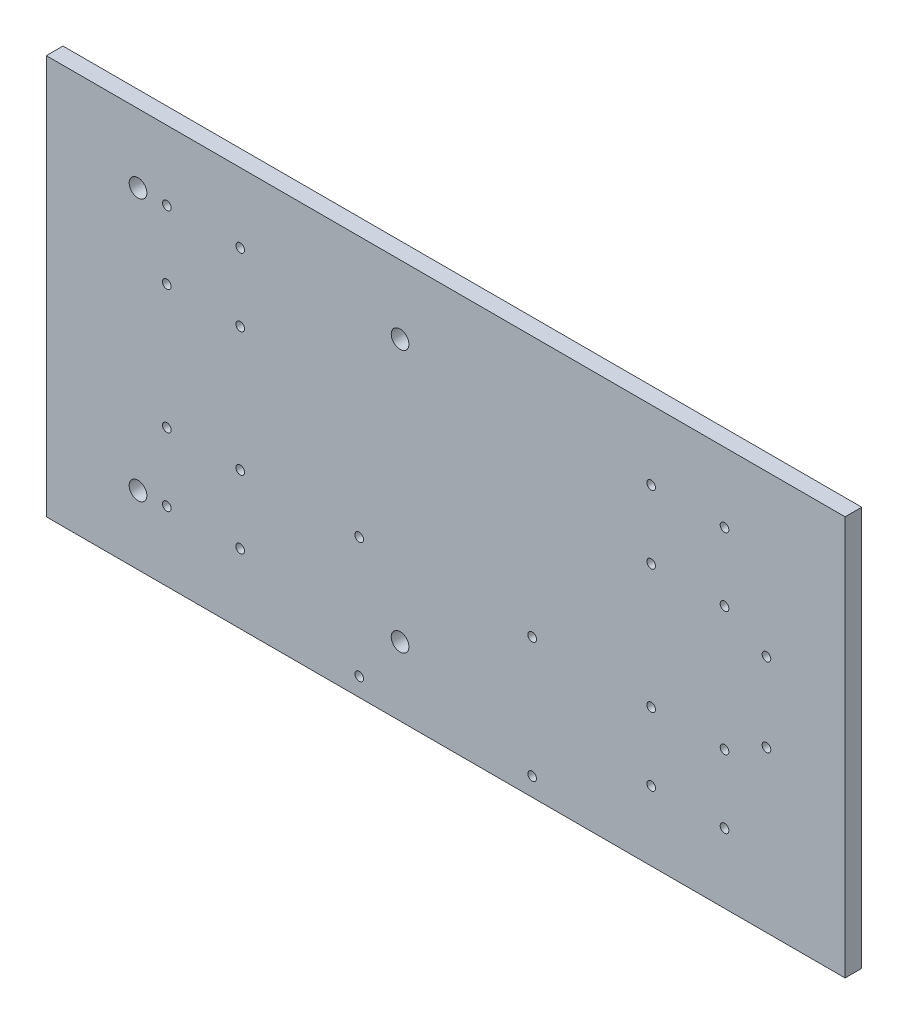
ISO-10303-21;
HEADER;
FILE_DESCRIPTION(('STEP AP214'),'2;1');
FILE_NAME('part.step','',(''),(''),'','','');
FILE_SCHEMA(('AUTOMOTIVE_DESIGN { 1 0 10303 214 1 1 1 1 }'));
ENDSEC;
DATA;
#1=APPLICATION_CONTEXT('core data for automotive mechanical design processes');
#2=APPLICATION_PROTOCOL_DEFINITION('international standard','automotive_design',2000,#1);
#3=PRODUCT_CONTEXT('',#1,'mechanical');
#4=PRODUCT('Part','Part','',(#3));
#5=PRODUCT_RELATED_PRODUCT_CATEGORY('part','',(#4));
#6=PRODUCT_DEFINITION_FORMATION('','',#4);
#7=PRODUCT_DEFINITION_CONTEXT('part definition',#1,'design');
#8=PRODUCT_DEFINITION('design','',#6,#7);
#9=PRODUCT_DEFINITION_SHAPE('','',#8);
#10=(LENGTH_UNIT() NAMED_UNIT(*) SI_UNIT(.MILLI.,.METRE.));
#11=(NAMED_UNIT(*) PLANE_ANGLE_UNIT() SI_UNIT($,.RADIAN.));
#12=(NAMED_UNIT(*) SI_UNIT($,.STERADIAN.) SOLID_ANGLE_UNIT());
#13=UNCERTAINTY_MEASURE_WITH_UNIT(LENGTH_MEASURE(1.E-05),#10,'distance_accuracy_value','');
#14=(GEOMETRIC_REPRESENTATION_CONTEXT(3) GLOBAL_UNCERTAINTY_ASSIGNED_CONTEXT((#13)) GLOBAL_UNIT_ASSIGNED_CONTEXT((#10,
#11,#12)) REPRESENTATION_CONTEXT('',''));
#15=CARTESIAN_POINT('',(0.,0.,0.));
#16=DIRECTION('',(0.,0.,1.));
#17=DIRECTION('',(1.,0.,0.));
#18=AXIS2_PLACEMENT_3D('',#15,#16,#17);
#19=CARTESIAN_POINT('',(152.4,76.2,6.35));
#20=DIRECTION('',(-1.,0.,0.));
#21=DIRECTION('',(0.,0.,1.));
#22=AXIS2_PLACEMENT_3D('',#19,#20,#21);
#23=PLANE('',#22);
#24=DIRECTION('',(0.,1.,0.));
#25=VECTOR('',#24,1.);
#26=CARTESIAN_POINT('',(152.4,76.2,0.));
#27=LINE('',#26,#25);
#28=CARTESIAN_POINT('',(152.4,-76.2,0.));
#29=VERTEX_POINT('',#28);
#30=CARTESIAN_POINT('',(152.4,76.2,0.));
#31=VERTEX_POINT('',#30);
#32=EDGE_CURVE('E97',#29,#31,#27,.T.);
#33=ORIENTED_EDGE('',*,*,#32,.T.);
#34=DIRECTION('',(0.,0.,-1.));
#35=VECTOR('',#34,1.);
#36=CARTESIAN_POINT('',(152.4,76.2,6.35));
#37=LINE('',#36,#35);
#38=CARTESIAN_POINT('',(152.4,76.2,6.35));
#39=VERTEX_POINT('',#38);
#40=EDGE_CURVE('E11',#39,#31,#37,.T.);
#41=ORIENTED_EDGE('',*,*,#40,.F.);
#42=DIRECTION('',(0.,1.,0.));
#43=VECTOR('',#42,1.);
#44=CARTESIAN_POINT('',(152.4,76.2,6.35));
#45=LINE('',#44,#43);
#46=CARTESIAN_POINT('',(152.4,-76.2,6.35));
#47=VERTEX_POINT('',#46);
#48=EDGE_CURVE('E85',#47,#39,#45,.T.);
#49=ORIENTED_EDGE('',*,*,#48,.F.);
#50=DIRECTION('',(0.,0.,-1.));
#51=VECTOR('',#50,1.);
#52=CARTESIAN_POINT('',(152.4,-76.2,6.35));
#53=LINE('',#52,#51);
#54=EDGE_CURVE('E93',#47,#29,#53,.T.);
#55=ORIENTED_EDGE('',*,*,#54,.T.);
#56=EDGE_LOOP('',(#33,#41,#49,#55));
#57=FACE_BOUND('',#56,.T.);
#58=ADVANCED_FACE('F34',(#57),#23,.F.);
#59=CARTESIAN_POINT('',(-152.4,76.2,6.35));
#60=DIRECTION('',(0.,-1.,0.));
#61=DIRECTION('',(0.,0.,-1.));
#62=AXIS2_PLACEMENT_3D('',#59,#60,#61);
#63=PLANE('',#62);
#64=DIRECTION('',(-1.,0.,0.));
#65=VECTOR('',#64,1.);
#66=CARTESIAN_POINT('',(-152.4,76.2,0.));
#67=LINE('',#66,#65);
#68=CARTESIAN_POINT('',(-152.4,76.2,0.));
#69=VERTEX_POINT('',#68);
#70=EDGE_CURVE('E89',#31,#69,#67,.T.);
#71=ORIENTED_EDGE('',*,*,#70,.T.);
#72=DIRECTION('',(0.,0.,-1.));
#73=VECTOR('',#72,1.);
#74=CARTESIAN_POINT('',(-152.4,76.2,6.35));
#75=LINE('',#74,#73);
#76=CARTESIAN_POINT('',(-152.4,76.2,6.35));
#77=VERTEX_POINT('',#76);
#78=EDGE_CURVE('E42',#77,#69,#75,.T.);
#79=ORIENTED_EDGE('',*,*,#78,.F.);
#80=DIRECTION('',(-1.,0.,0.));
#81=VECTOR('',#80,1.);
#82=CARTESIAN_POINT('',(-152.4,76.2,6.35));
#83=LINE('',#82,#81);
#84=EDGE_CURVE('E80',#39,#77,#83,.T.);
#85=ORIENTED_EDGE('',*,*,#84,.F.);
#86=ORIENTED_EDGE('',*,*,#40,.T.);
#87=EDGE_LOOP('',(#71,#79,#85,#86));
#88=FACE_BOUND('',#87,.T.);
#89=ADVANCED_FACE('F88',(#88),#63,.F.);
#90=CARTESIAN_POINT('',(-152.4,76.2,6.35));
#91=DIRECTION('',(1.,0.,0.));
#92=DIRECTION('',(0.,1.,0.));
#93=AXIS2_PLACEMENT_3D('',#90,#91,#92);
#94=PLANE('',#93);
#95=DIRECTION('',(0.,-1.,0.));
#96=VECTOR('',#95,1.);
#97=CARTESIAN_POINT('',(-152.4,76.2,0.));
#98=LINE('',#97,#96);
#99=CARTESIAN_POINT('',(-152.4,-76.2,0.));
#100=VERTEX_POINT('',#99);
#101=EDGE_CURVE('E67',#69,#100,#98,.T.);
#102=ORIENTED_EDGE('',*,*,#101,.T.);
#103=DIRECTION('',(0.,0.,-1.));
#104=VECTOR('',#103,1.);
#105=CARTESIAN_POINT('',(-152.4,-76.2,6.35));
#106=LINE('',#105,#104);
#107=CARTESIAN_POINT('',(-152.4,-76.2,6.35));
#108=VERTEX_POINT('',#107);
#109=EDGE_CURVE('E90',#108,#100,#106,.T.);
#110=ORIENTED_EDGE('',*,*,#109,.F.);
#111=DIRECTION('',(0.,-1.,0.));
#112=VECTOR('',#111,1.);
#113=CARTESIAN_POINT('',(-152.4,76.2,6.35));
#114=LINE('',#113,#112);
#115=EDGE_CURVE('E83',#77,#108,#114,.T.);
#116=ORIENTED_EDGE('',*,*,#115,.F.);
#117=ORIENTED_EDGE('',*,*,#78,.T.);
#118=EDGE_LOOP('',(#102,#110,#116,#117));
#119=FACE_BOUND('',#118,.T.);
#120=ADVANCED_FACE('F91',(#119),#94,.F.);
#121=CARTESIAN_POINT('',(-152.4,-76.2,6.35));
#122=DIRECTION('',(0.,1.,0.));
#123=DIRECTION('',(0.,0.,1.));
#124=AXIS2_PLACEMENT_3D('',#121,#122,#123);
#125=PLANE('',#124);
#126=DIRECTION('',(1.,0.,0.));
#127=VECTOR('',#126,1.);
#128=CARTESIAN_POINT('',(-152.4,-76.2,0.));
#129=LINE('',#128,#127);
#130=EDGE_CURVE('E73',#100,#29,#129,.T.);
#131=ORIENTED_EDGE('',*,*,#130,.T.);
#132=ORIENTED_EDGE('',*,*,#54,.F.);
#133=DIRECTION('',(1.,0.,0.));
#134=VECTOR('',#133,1.);
#135=CARTESIAN_POINT('',(-152.4,-76.2,6.35));
#136=LINE('',#135,#134);
#137=EDGE_CURVE('E50',#108,#47,#136,.T.);
#138=ORIENTED_EDGE('',*,*,#137,.F.);
#139=ORIENTED_EDGE('',*,*,#109,.T.);
#140=EDGE_LOOP('',(#131,#132,#138,#139));
#141=FACE_BOUND('',#140,.T.);
#142=ADVANCED_FACE('F105',(#141),#125,.F.);
#143=CARTESIAN_POINT('',(0.,0.,6.35));
#144=DIRECTION('',(0.,0.,1.));
#145=DIRECTION('',(1.,0.,0.));
#146=AXIS2_PLACEMENT_3D('',#143,#144,#145);
#147=PLANE('',#146);
#148=CARTESIAN_POINT('',(122.4,-15.,6.35));
#149=DIRECTION('',(0.,0.,1.));
#150=DIRECTION('',(1.,0.,0.));
#151=AXIS2_PLACEMENT_3D('',#148,#149,#150);
#152=CIRCLE('',#151,1.65000000000002);
#153=CARTESIAN_POINT('',(124.05,-15.,6.35));
#154=VERTEX_POINT('',#153);
#155=EDGE_CURVE('E261',#154,#154,#152,.T.);
#156=ORIENTED_EDGE('',*,*,#155,.F.);
#157=EDGE_LOOP('',(#156));
#158=FACE_BOUND('',#157,.T.);
#159=CARTESIAN_POINT('',(122.4,15.,6.35));
#160=DIRECTION('',(0.,0.,1.));
#161=DIRECTION('',(1.,0.,0.));
#162=AXIS2_PLACEMENT_3D('',#159,#160,#161);
#163=CIRCLE('',#162,1.65000000000002);
#164=CARTESIAN_POINT('',(124.05,15.,6.35));
#165=VERTEX_POINT('',#164);
#166=EDGE_CURVE('E255',#165,#165,#163,.T.);
#167=ORIENTED_EDGE('',*,*,#166,.F.);
#168=EDGE_LOOP('',(#167));
#169=FACE_BOUND('',#168,.T.);
#170=CARTESIAN_POINT('',(-32.9999999999985,-23.2,6.35));
#171=DIRECTION('',(0.,0.,-1.));
#172=DIRECTION('',(-1.,0.,0.));
#173=AXIS2_PLACEMENT_3D('',#170,#171,#172);
#174=CIRCLE('',#173,1.65);
#175=CARTESIAN_POINT('',(-34.6499999999985,-23.2,6.35));
#176=VERTEX_POINT('',#175);
#177=EDGE_CURVE('E234',#176,#176,#174,.T.);
#178=ORIENTED_EDGE('',*,*,#177,.T.);
#179=EDGE_LOOP('',(#178));
#180=FACE_BOUND('',#179,.T.);
#181=CARTESIAN_POINT('',(33.0000000000015,-23.2,6.35));
#182=DIRECTION('',(0.,0.,-1.));
#183=DIRECTION('',(-1.,0.,0.));
#184=AXIS2_PLACEMENT_3D('',#181,#182,#183);
#185=CIRCLE('',#184,1.65);
#186=CARTESIAN_POINT('',(31.3500000000015,-23.2,6.35));
#187=VERTEX_POINT('',#186);
#188=EDGE_CURVE('E247',#187,#187,#185,.T.);
#189=ORIENTED_EDGE('',*,*,#188,.T.);
#190=EDGE_LOOP('',(#189));
#191=FACE_BOUND('',#190,.T.);
#192=CARTESIAN_POINT('',(33.0000000000015,-69.2,6.35));
#193=DIRECTION('',(0.,0.,-1.));
#194=DIRECTION('',(-1.,0.,0.));
#195=AXIS2_PLACEMENT_3D('',#192,#193,#194);
#196=CIRCLE('',#195,1.65);
#197=CARTESIAN_POINT('',(31.3500000000015,-69.2,6.35));
#198=VERTEX_POINT('',#197);
#199=EDGE_CURVE('E240',#198,#198,#196,.T.);
#200=ORIENTED_EDGE('',*,*,#199,.T.);
#201=EDGE_LOOP('',(#200));
#202=FACE_BOUND('',#201,.T.);
#203=CARTESIAN_POINT('',(-32.9999999999985,-69.2,6.35));
#204=DIRECTION('',(0.,0.,-1.));
#205=DIRECTION('',(-1.,0.,0.));
#206=AXIS2_PLACEMENT_3D('',#203,#204,#205);
#207=CIRCLE('',#206,1.65);
#208=CARTESIAN_POINT('',(-34.6499999999985,-69.2,6.35));
#209=VERTEX_POINT('',#208);
#210=EDGE_CURVE('E217',#209,#209,#207,.T.);
#211=ORIENTED_EDGE('',*,*,#210,.T.);
#212=EDGE_LOOP('',(#211));
#213=FACE_BOUND('',#212,.T.);
#214=CARTESIAN_POINT('',(-117.4,49.9998733487398,6.35));
#215=DIRECTION('',(0.,0.,1.));
#216=DIRECTION('',(1.,0.,0.));
#217=AXIS2_PLACEMENT_3D('',#214,#215,#216);
#218=CIRCLE('',#217,3.375);
#219=CARTESIAN_POINT('',(-114.025,49.9998733487398,6.35));
#220=VERTEX_POINT('',#219);
#221=EDGE_CURVE('E226',#220,#220,#218,.T.);
#222=ORIENTED_EDGE('',*,*,#221,.F.);
#223=EDGE_LOOP('',(#222));
#224=FACE_BOUND('',#223,.T.);
#225=CARTESIAN_POINT('',(-17.4000000000002,-50.0001266512602,6.35));
#226=DIRECTION('',(0.,0.,1.));
#227=DIRECTION('',(1.,0.,0.));
#228=AXIS2_PLACEMENT_3D('',#225,#226,#227);
#229=CIRCLE('',#228,3.375);
#230=CARTESIAN_POINT('',(-14.0250000000002,-50.0001266512602,6.35));
#231=VERTEX_POINT('',#230);
#232=EDGE_CURVE('E220',#231,#231,#229,.T.);
#233=ORIENTED_EDGE('',*,*,#232,.F.);
#234=EDGE_LOOP('',(#233));
#235=FACE_BOUND('',#234,.T.);
#236=CARTESIAN_POINT('',(-17.4000000000002,49.9998733487398,6.35));
#237=DIRECTION('',(0.,0.,1.));
#238=DIRECTION('',(1.,0.,0.));
#239=AXIS2_PLACEMENT_3D('',#236,#237,#238);
#240=CIRCLE('',#239,3.375);
#241=CARTESIAN_POINT('',(-14.0250000000002,49.9998733487398,6.35));
#242=VERTEX_POINT('',#241);
#243=EDGE_CURVE('E213',#242,#242,#240,.T.);
#244=ORIENTED_EDGE('',*,*,#243,.F.);
#245=EDGE_LOOP('',(#244));
#246=FACE_BOUND('',#245,.T.);
#247=CARTESIAN_POINT('',(-117.4,-50.0001266512602,6.35));
#248=DIRECTION('',(0.,0.,1.));
#249=DIRECTION('',(1.,0.,0.));
#250=AXIS2_PLACEMENT_3D('',#247,#248,#249);
#251=CIRCLE('',#250,3.375);
#252=CARTESIAN_POINT('',(-114.025,-50.0001266512602,6.35));
#253=VERTEX_POINT('',#252);
#254=EDGE_CURVE('E207',#253,#253,#251,.T.);
#255=ORIENTED_EDGE('',*,*,#254,.F.);
#256=EDGE_LOOP('',(#255));
#257=FACE_BOUND('',#256,.T.);
#258=CARTESIAN_POINT('',(78.4,49.7,6.35));
#259=DIRECTION('',(0.,0.,1.));
#260=DIRECTION('',(1.,0.,0.));
#261=AXIS2_PLACEMENT_3D('',#258,#259,#260);
#262=CIRCLE('',#261,1.65);
#263=CARTESIAN_POINT('',(80.05,49.7,6.35));
#264=VERTEX_POINT('',#263);
#265=EDGE_CURVE('E200',#264,#264,#262,.T.);
#266=ORIENTED_EDGE('',*,*,#265,.F.);
#267=EDGE_LOOP('',(#266));
#268=FACE_BOUND('',#267,.T.);
#269=CARTESIAN_POINT('',(78.4,23.7,6.35));
#270=DIRECTION('',(0.,0.,1.));
#271=DIRECTION('',(1.,0.,0.));
#272=AXIS2_PLACEMENT_3D('',#269,#270,#271);
#273=CIRCLE('',#272,1.65);
#274=CARTESIAN_POINT('',(80.05,23.7,6.35));
#275=VERTEX_POINT('',#274);
#276=EDGE_CURVE('E194',#275,#275,#273,.T.);
#277=ORIENTED_EDGE('',*,*,#276,.F.);
#278=EDGE_LOOP('',(#277));
#279=FACE_BOUND('',#278,.T.);
#280=CARTESIAN_POINT('',(106.4,23.7,6.35));
#281=DIRECTION('',(0.,0.,1.));
#282=DIRECTION('',(1.,0.,0.));
#283=AXIS2_PLACEMENT_3D('',#280,#281,#282);
#284=CIRCLE('',#283,1.65);
#285=CARTESIAN_POINT('',(108.05,23.7,6.35));
#286=VERTEX_POINT('',#285);
#287=EDGE_CURVE('E188',#286,#286,#284,.T.);
#288=ORIENTED_EDGE('',*,*,#287,.F.);
#289=EDGE_LOOP('',(#288));
#290=FACE_BOUND('',#289,.T.);
#291=CARTESIAN_POINT('',(106.4,49.7,6.35));
#292=DIRECTION('',(0.,0.,1.));
#293=DIRECTION('',(1.,0.,0.));
#294=AXIS2_PLACEMENT_3D('',#291,#292,#293);
#295=CIRCLE('',#294,1.65);
#296=CARTESIAN_POINT('',(108.05,49.7,6.35));
#297=VERTEX_POINT('',#296);
#298=EDGE_CURVE('E182',#297,#297,#295,.T.);
#299=ORIENTED_EDGE('',*,*,#298,.F.);
#300=EDGE_LOOP('',(#299));
#301=FACE_BOUND('',#300,.T.);
#302=CARTESIAN_POINT('',(78.4,-23.6999999999998,6.35));
#303=DIRECTION('',(0.,0.,1.));
#304=DIRECTION('',(1.,0.,0.));
#305=AXIS2_PLACEMENT_3D('',#302,#303,#304);
#306=CIRCLE('',#305,1.65);
#307=CARTESIAN_POINT('',(80.05,-23.6999999999998,6.35));
#308=VERTEX_POINT('',#307);
#309=EDGE_CURVE('E176',#308,#308,#306,.T.);
#310=ORIENTED_EDGE('',*,*,#309,.F.);
#311=EDGE_LOOP('',(#310));
#312=FACE_BOUND('',#311,.T.);
#313=CARTESIAN_POINT('',(78.4,-49.6999999999998,6.35));
#314=DIRECTION('',(0.,0.,1.));
#315=DIRECTION('',(1.,0.,0.));
#316=AXIS2_PLACEMENT_3D('',#313,#314,#315);
#317=CIRCLE('',#316,1.65);
#318=CARTESIAN_POINT('',(80.05,-49.6999999999998,6.35));
#319=VERTEX_POINT('',#318);
#320=EDGE_CURVE('E170',#319,#319,#317,.T.);
#321=ORIENTED_EDGE('',*,*,#320,.F.);
#322=EDGE_LOOP('',(#321));
#323=FACE_BOUND('',#322,.T.);
#324=CARTESIAN_POINT('',(106.4,-23.6999999999998,6.35));
#325=DIRECTION('',(0.,0.,1.));
#326=DIRECTION('',(1.,0.,0.));
#327=AXIS2_PLACEMENT_3D('',#324,#325,#326);
#328=CIRCLE('',#327,1.65);
#329=CARTESIAN_POINT('',(108.05,-23.6999999999998,6.35));
#330=VERTEX_POINT('',#329);
#331=EDGE_CURVE('E164',#330,#330,#328,.T.);
#332=ORIENTED_EDGE('',*,*,#331,.F.);
#333=EDGE_LOOP('',(#332));
#334=FACE_BOUND('',#333,.T.);
#335=CARTESIAN_POINT('',(106.4,-49.6999999999998,6.35));
#336=DIRECTION('',(0.,0.,1.));
#337=DIRECTION('',(1.,0.,0.));
#338=AXIS2_PLACEMENT_3D('',#335,#336,#337);
#339=CIRCLE('',#338,1.65);
#340=CARTESIAN_POINT('',(108.05,-49.6999999999998,6.35));
#341=VERTEX_POINT('',#340);
#342=EDGE_CURVE('E158',#341,#341,#339,.T.);
#343=ORIENTED_EDGE('',*,*,#342,.F.);
#344=EDGE_LOOP('',(#343));
#345=FACE_BOUND('',#344,.T.);
#346=CARTESIAN_POINT('',(-106.4,49.6999999999999,6.35));
#347=DIRECTION('',(0.,0.,1.));
#348=DIRECTION('',(1.,0.,0.));
#349=AXIS2_PLACEMENT_3D('',#346,#347,#348);
#350=CIRCLE('',#349,1.65);
#351=CARTESIAN_POINT('',(-104.75,49.6999999999999,6.35));
#352=VERTEX_POINT('',#351);
#353=EDGE_CURVE('E152',#352,#352,#350,.T.);
#354=ORIENTED_EDGE('',*,*,#353,.F.);
#355=EDGE_LOOP('',(#354));
#356=FACE_BOUND('',#355,.T.);
#357=CARTESIAN_POINT('',(-78.4,49.6999999999999,6.35));
#358=DIRECTION('',(0.,0.,1.));
#359=DIRECTION('',(1.,0.,0.));
#360=AXIS2_PLACEMENT_3D('',#357,#358,#359);
#361=CIRCLE('',#360,1.65);
#362=CARTESIAN_POINT('',(-76.75,49.6999999999999,6.35));
#363=VERTEX_POINT('',#362);
#364=EDGE_CURVE('E146',#363,#363,#361,.T.);
#365=ORIENTED_EDGE('',*,*,#364,.F.);
#366=EDGE_LOOP('',(#365));
#367=FACE_BOUND('',#366,.T.);
#368=CARTESIAN_POINT('',(-78.4,23.6999999999999,6.35));
#369=DIRECTION('',(0.,0.,1.));
#370=DIRECTION('',(1.,0.,0.));
#371=AXIS2_PLACEMENT_3D('',#368,#369,#370);
#372=CIRCLE('',#371,1.65);
#373=CARTESIAN_POINT('',(-76.75,23.6999999999999,6.35));
#374=VERTEX_POINT('',#373);
#375=EDGE_CURVE('E140',#374,#374,#372,.T.);
#376=ORIENTED_EDGE('',*,*,#375,.F.);
#377=EDGE_LOOP('',(#376));
#378=FACE_BOUND('',#377,.T.);
#379=CARTESIAN_POINT('',(-106.4,23.6999999999999,6.35));
#380=DIRECTION('',(0.,0.,1.));
#381=DIRECTION('',(1.,0.,0.));
#382=AXIS2_PLACEMENT_3D('',#379,#380,#381);
#383=CIRCLE('',#382,1.65);
#384=CARTESIAN_POINT('',(-104.75,23.6999999999999,6.35));
#385=VERTEX_POINT('',#384);
#386=EDGE_CURVE('E134',#385,#385,#383,.T.);
#387=ORIENTED_EDGE('',*,*,#386,.F.);
#388=EDGE_LOOP('',(#387));
#389=FACE_BOUND('',#388,.T.);
#390=CARTESIAN_POINT('',(-106.4,-23.6999999999999,6.35));
#391=DIRECTION('',(0.,0.,1.));
#392=DIRECTION('',(1.,0.,0.));
#393=AXIS2_PLACEMENT_3D('',#390,#391,#392);
#394=CIRCLE('',#393,1.65);
#395=CARTESIAN_POINT('',(-104.75,-23.6999999999999,6.35));
#396=VERTEX_POINT('',#395);
#397=EDGE_CURVE('E128',#396,#396,#394,.T.);
#398=ORIENTED_EDGE('',*,*,#397,.F.);
#399=EDGE_LOOP('',(#398));
#400=FACE_BOUND('',#399,.T.);
#401=CARTESIAN_POINT('',(-106.4,-49.6999999999999,6.35));
#402=DIRECTION('',(0.,0.,1.));
#403=DIRECTION('',(1.,0.,0.));
#404=AXIS2_PLACEMENT_3D('',#401,#402,#403);
#405=CIRCLE('',#404,1.65);
#406=CARTESIAN_POINT('',(-104.75,-49.6999999999999,6.35));
#407=VERTEX_POINT('',#406);
#408=EDGE_CURVE('E122',#407,#407,#405,.T.);
#409=ORIENTED_EDGE('',*,*,#408,.F.);
#410=EDGE_LOOP('',(#409));
#411=FACE_BOUND('',#410,.T.);
#412=CARTESIAN_POINT('',(-78.4,-23.6999999999999,6.35));
#413=DIRECTION('',(0.,0.,1.));
#414=DIRECTION('',(1.,0.,0.));
#415=AXIS2_PLACEMENT_3D('',#412,#413,#414);
#416=CIRCLE('',#415,1.65);
#417=CARTESIAN_POINT('',(-76.75,-23.6999999999999,6.35));
#418=VERTEX_POINT('',#417);
#419=EDGE_CURVE('E116',#418,#418,#416,.T.);
#420=ORIENTED_EDGE('',*,*,#419,.F.);
#421=EDGE_LOOP('',(#420));
#422=FACE_BOUND('',#421,.T.);
#423=CARTESIAN_POINT('',(-78.4,-49.6999999999999,6.35));
#424=DIRECTION('',(0.,0.,1.));
#425=DIRECTION('',(1.,0.,0.));
#426=AXIS2_PLACEMENT_3D('',#423,#424,#425);
#427=CIRCLE('',#426,1.65);
#428=CARTESIAN_POINT('',(-76.75,-49.6999999999999,6.35));
#429=VERTEX_POINT('',#428);
#430=EDGE_CURVE('E100',#429,#429,#427,.T.);
#431=ORIENTED_EDGE('',*,*,#430,.F.);
#432=EDGE_LOOP('',(#431));
#433=FACE_BOUND('',#432,.T.);
#434=ORIENTED_EDGE('',*,*,#48,.T.);
#435=ORIENTED_EDGE('',*,*,#84,.T.);
#436=ORIENTED_EDGE('',*,*,#115,.T.);
#437=ORIENTED_EDGE('',*,*,#137,.T.);
#438=EDGE_LOOP('',(#434,#435,#436,#437));
#439=FACE_BOUND('',#438,.T.);
#440=ADVANCED_FACE('F81',(#158,#169,#180,#191,#202,#213,#224,#235,#246,#257,#268,#279,#290,#301,
#312,#323,#334,#345,#356,#367,#378,#389,#400,#411,#422,#433,#439),#147,.T.);
#441=CARTESIAN_POINT('',(0.,0.,0.));
#442=DIRECTION('',(0.,0.,1.));
#443=DIRECTION('',(1.,0.,0.));
#444=AXIS2_PLACEMENT_3D('',#441,#442,#443);
#445=PLANE('',#444);
#446=CARTESIAN_POINT('',(122.4,-15.,0.));
#447=DIRECTION('',(0.,0.,1.));
#448=DIRECTION('',(1.,0.,0.));
#449=AXIS2_PLACEMENT_3D('',#446,#447,#448);
#450=CIRCLE('',#449,1.65000000000002);
#451=CARTESIAN_POINT('',(124.05,-15.,0.));
#452=VERTEX_POINT('',#451);
#453=EDGE_CURVE('E258',#452,#452,#450,.T.);
#454=ORIENTED_EDGE('',*,*,#453,.T.);
#455=EDGE_LOOP('',(#454));
#456=FACE_BOUND('',#455,.T.);
#457=CARTESIAN_POINT('',(122.4,15.,0.));
#458=DIRECTION('',(0.,0.,1.));
#459=DIRECTION('',(1.,0.,0.));
#460=AXIS2_PLACEMENT_3D('',#457,#458,#459);
#461=CIRCLE('',#460,1.65000000000002);
#462=CARTESIAN_POINT('',(124.05,15.,0.));
#463=VERTEX_POINT('',#462);
#464=EDGE_CURVE('E241',#463,#463,#461,.T.);
#465=ORIENTED_EDGE('',*,*,#464,.T.);
#466=EDGE_LOOP('',(#465));
#467=FACE_BOUND('',#466,.T.);
#468=CARTESIAN_POINT('',(-32.9999999999985,-23.2,0.));
#469=DIRECTION('',(0.,0.,-1.));
#470=DIRECTION('',(-1.,0.,0.));
#471=AXIS2_PLACEMENT_3D('',#468,#469,#470);
#472=CIRCLE('',#471,1.65);
#473=CARTESIAN_POINT('',(-34.6499999999985,-23.2,0.));
#474=VERTEX_POINT('',#473);
#475=EDGE_CURVE('E250',#474,#474,#472,.T.);
#476=ORIENTED_EDGE('',*,*,#475,.F.);
#477=EDGE_LOOP('',(#476));
#478=FACE_BOUND('',#477,.T.);
#479=CARTESIAN_POINT('',(33.0000000000015,-23.2,0.));
#480=DIRECTION('',(0.,0.,-1.));
#481=DIRECTION('',(-1.,0.,0.));
#482=AXIS2_PLACEMENT_3D('',#479,#480,#481);
#483=CIRCLE('',#482,1.65);
#484=CARTESIAN_POINT('',(31.3500000000015,-23.2,0.));
#485=VERTEX_POINT('',#484);
#486=EDGE_CURVE('E244',#485,#485,#483,.T.);
#487=ORIENTED_EDGE('',*,*,#486,.F.);
#488=EDGE_LOOP('',(#487));
#489=FACE_BOUND('',#488,.T.);
#490=CARTESIAN_POINT('',(33.0000000000015,-69.2,0.));
#491=DIRECTION('',(0.,0.,-1.));
#492=DIRECTION('',(-1.,0.,0.));
#493=AXIS2_PLACEMENT_3D('',#490,#491,#492);
#494=CIRCLE('',#493,1.65);
#495=CARTESIAN_POINT('',(31.3500000000015,-69.2,0.));
#496=VERTEX_POINT('',#495);
#497=EDGE_CURVE('E237',#496,#496,#494,.T.);
#498=ORIENTED_EDGE('',*,*,#497,.F.);
#499=EDGE_LOOP('',(#498));
#500=FACE_BOUND('',#499,.T.);
#501=CARTESIAN_POINT('',(-32.9999999999985,-69.2,0.));
#502=DIRECTION('',(0.,0.,-1.));
#503=DIRECTION('',(-1.,0.,0.));
#504=AXIS2_PLACEMENT_3D('',#501,#502,#503);
#505=CIRCLE('',#504,1.65);
#506=CARTESIAN_POINT('',(-34.6499999999985,-69.2,0.));
#507=VERTEX_POINT('',#506);
#508=EDGE_CURVE('E231',#507,#507,#505,.T.);
#509=ORIENTED_EDGE('',*,*,#508,.F.);
#510=EDGE_LOOP('',(#509));
#511=FACE_BOUND('',#510,.T.);
#512=CARTESIAN_POINT('',(-117.4,49.9998733487398,0.));
#513=DIRECTION('',(0.,0.,1.));
#514=DIRECTION('',(1.,0.,0.));
#515=AXIS2_PLACEMENT_3D('',#512,#513,#514);
#516=CIRCLE('',#515,3.375);
#517=CARTESIAN_POINT('',(-114.025,49.9998733487398,0.));
#518=VERTEX_POINT('',#517);
#519=EDGE_CURVE('E210',#518,#518,#516,.T.);
#520=ORIENTED_EDGE('',*,*,#519,.T.);
#521=EDGE_LOOP('',(#520));
#522=FACE_BOUND('',#521,.T.);
#523=CARTESIAN_POINT('',(-17.4000000000002,-50.0001266512602,0.));
#524=DIRECTION('',(0.,0.,1.));
#525=DIRECTION('',(1.,0.,0.));
#526=AXIS2_PLACEMENT_3D('',#523,#524,#525);
#527=CIRCLE('',#526,3.375);
#528=CARTESIAN_POINT('',(-14.0250000000002,-50.0001266512602,0.));
#529=VERTEX_POINT('',#528);
#530=EDGE_CURVE('E223',#529,#529,#527,.T.);
#531=ORIENTED_EDGE('',*,*,#530,.T.);
#532=EDGE_LOOP('',(#531));
#533=FACE_BOUND('',#532,.T.);
#534=CARTESIAN_POINT('',(-17.4000000000002,49.9998733487398,0.));
#535=DIRECTION('',(0.,0.,1.));
#536=DIRECTION('',(1.,0.,0.));
#537=AXIS2_PLACEMENT_3D('',#534,#535,#536);
#538=CIRCLE('',#537,3.375);
#539=CARTESIAN_POINT('',(-14.0250000000002,49.9998733487398,0.));
#540=VERTEX_POINT('',#539);
#541=EDGE_CURVE('E216',#540,#540,#538,.T.);
#542=ORIENTED_EDGE('',*,*,#541,.T.);
#543=EDGE_LOOP('',(#542));
#544=FACE_BOUND('',#543,.T.);
#545=CARTESIAN_POINT('',(-117.4,-50.0001266512602,0.));
#546=DIRECTION('',(0.,0.,1.));
#547=DIRECTION('',(1.,0.,0.));
#548=AXIS2_PLACEMENT_3D('',#545,#546,#547);
#549=CIRCLE('',#548,3.375);
#550=CARTESIAN_POINT('',(-114.025,-50.0001266512602,0.));
#551=VERTEX_POINT('',#550);
#552=EDGE_CURVE('E206',#551,#551,#549,.T.);
#553=ORIENTED_EDGE('',*,*,#552,.T.);
#554=EDGE_LOOP('',(#553));
#555=FACE_BOUND('',#554,.T.);
#556=CARTESIAN_POINT('',(78.4,49.7,0.));
#557=DIRECTION('',(0.,0.,-1.));
#558=DIRECTION('',(-1.,0.,0.));
#559=AXIS2_PLACEMENT_3D('',#556,#557,#558);
#560=CIRCLE('',#559,1.65);
#561=CARTESIAN_POINT('',(76.75,49.7,0.));
#562=VERTEX_POINT('',#561);
#563=EDGE_CURVE('E203',#562,#562,#560,.T.);
#564=ORIENTED_EDGE('',*,*,#563,.F.);
#565=EDGE_LOOP('',(#564));
#566=FACE_BOUND('',#565,.T.);
#567=CARTESIAN_POINT('',(78.4,23.7,0.));
#568=DIRECTION('',(0.,0.,-1.));
#569=DIRECTION('',(-1.,0.,0.));
#570=AXIS2_PLACEMENT_3D('',#567,#568,#569);
#571=CIRCLE('',#570,1.65);
#572=CARTESIAN_POINT('',(76.75,23.7,0.));
#573=VERTEX_POINT('',#572);
#574=EDGE_CURVE('E197',#573,#573,#571,.T.);
#575=ORIENTED_EDGE('',*,*,#574,.F.);
#576=EDGE_LOOP('',(#575));
#577=FACE_BOUND('',#576,.T.);
#578=CARTESIAN_POINT('',(106.4,23.7,0.));
#579=DIRECTION('',(0.,0.,-1.));
#580=DIRECTION('',(-1.,0.,0.));
#581=AXIS2_PLACEMENT_3D('',#578,#579,#580);
#582=CIRCLE('',#581,1.65);
#583=CARTESIAN_POINT('',(104.75,23.7,0.));
#584=VERTEX_POINT('',#583);
#585=EDGE_CURVE('E191',#584,#584,#582,.T.);
#586=ORIENTED_EDGE('',*,*,#585,.F.);
#587=EDGE_LOOP('',(#586));
#588=FACE_BOUND('',#587,.T.);
#589=CARTESIAN_POINT('',(106.4,49.7,0.));
#590=DIRECTION('',(0.,0.,-1.));
#591=DIRECTION('',(-1.,0.,0.));
#592=AXIS2_PLACEMENT_3D('',#589,#590,#591);
#593=CIRCLE('',#592,1.65);
#594=CARTESIAN_POINT('',(104.75,49.7,0.));
#595=VERTEX_POINT('',#594);
#596=EDGE_CURVE('E185',#595,#595,#593,.T.);
#597=ORIENTED_EDGE('',*,*,#596,.F.);
#598=EDGE_LOOP('',(#597));
#599=FACE_BOUND('',#598,.T.);
#600=CARTESIAN_POINT('',(78.4,-23.6999999999998,0.));
#601=DIRECTION('',(0.,0.,-1.));
#602=DIRECTION('',(-1.,0.,0.));
#603=AXIS2_PLACEMENT_3D('',#600,#601,#602);
#604=CIRCLE('',#603,1.65);
#605=CARTESIAN_POINT('',(76.75,-23.6999999999998,0.));
#606=VERTEX_POINT('',#605);
#607=EDGE_CURVE('E179',#606,#606,#604,.T.);
#608=ORIENTED_EDGE('',*,*,#607,.F.);
#609=EDGE_LOOP('',(#608));
#610=FACE_BOUND('',#609,.T.);
#611=CARTESIAN_POINT('',(78.4,-49.6999999999998,0.));
#612=DIRECTION('',(0.,0.,-1.));
#613=DIRECTION('',(-1.,0.,0.));
#614=AXIS2_PLACEMENT_3D('',#611,#612,#613);
#615=CIRCLE('',#614,1.65);
#616=CARTESIAN_POINT('',(76.75,-49.6999999999998,0.));
#617=VERTEX_POINT('',#616);
#618=EDGE_CURVE('E173',#617,#617,#615,.T.);
#619=ORIENTED_EDGE('',*,*,#618,.F.);
#620=EDGE_LOOP('',(#619));
#621=FACE_BOUND('',#620,.T.);
#622=CARTESIAN_POINT('',(106.4,-23.6999999999998,0.));
#623=DIRECTION('',(0.,0.,-1.));
#624=DIRECTION('',(-1.,0.,0.));
#625=AXIS2_PLACEMENT_3D('',#622,#623,#624);
#626=CIRCLE('',#625,1.65);
#627=CARTESIAN_POINT('',(104.75,-23.6999999999998,0.));
#628=VERTEX_POINT('',#627);
#629=EDGE_CURVE('E167',#628,#628,#626,.T.);
#630=ORIENTED_EDGE('',*,*,#629,.F.);
#631=EDGE_LOOP('',(#630));
#632=FACE_BOUND('',#631,.T.);
#633=CARTESIAN_POINT('',(106.4,-49.6999999999998,0.));
#634=DIRECTION('',(0.,0.,-1.));
#635=DIRECTION('',(-1.,0.,0.));
#636=AXIS2_PLACEMENT_3D('',#633,#634,#635);
#637=CIRCLE('',#636,1.65);
#638=CARTESIAN_POINT('',(104.75,-49.6999999999998,0.));
#639=VERTEX_POINT('',#638);
#640=EDGE_CURVE('E161',#639,#639,#637,.T.);
#641=ORIENTED_EDGE('',*,*,#640,.F.);
#642=EDGE_LOOP('',(#641));
#643=FACE_BOUND('',#642,.T.);
#644=CARTESIAN_POINT('',(-106.4,49.6999999999999,0.));
#645=DIRECTION('',(0.,0.,-1.));
#646=DIRECTION('',(-1.,0.,0.));
#647=AXIS2_PLACEMENT_3D('',#644,#645,#646);
#648=CIRCLE('',#647,1.65);
#649=CARTESIAN_POINT('',(-108.05,49.6999999999999,0.));
#650=VERTEX_POINT('',#649);
#651=EDGE_CURVE('E155',#650,#650,#648,.T.);
#652=ORIENTED_EDGE('',*,*,#651,.F.);
#653=EDGE_LOOP('',(#652));
#654=FACE_BOUND('',#653,.T.);
#655=CARTESIAN_POINT('',(-78.4,49.6999999999999,0.));
#656=DIRECTION('',(0.,0.,-1.));
#657=DIRECTION('',(-1.,0.,0.));
#658=AXIS2_PLACEMENT_3D('',#655,#656,#657);
#659=CIRCLE('',#658,1.65);
#660=CARTESIAN_POINT('',(-80.05,49.6999999999999,0.));
#661=VERTEX_POINT('',#660);
#662=EDGE_CURVE('E149',#661,#661,#659,.T.);
#663=ORIENTED_EDGE('',*,*,#662,.F.);
#664=EDGE_LOOP('',(#663));
#665=FACE_BOUND('',#664,.T.);
#666=CARTESIAN_POINT('',(-78.4,23.6999999999999,0.));
#667=DIRECTION('',(0.,0.,-1.));
#668=DIRECTION('',(-1.,0.,0.));
#669=AXIS2_PLACEMENT_3D('',#666,#667,#668);
#670=CIRCLE('',#669,1.65);
#671=CARTESIAN_POINT('',(-80.05,23.6999999999999,0.));
#672=VERTEX_POINT('',#671);
#673=EDGE_CURVE('E143',#672,#672,#670,.T.);
#674=ORIENTED_EDGE('',*,*,#673,.F.);
#675=EDGE_LOOP('',(#674));
#676=FACE_BOUND('',#675,.T.);
#677=CARTESIAN_POINT('',(-106.4,23.6999999999999,0.));
#678=DIRECTION('',(0.,0.,-1.));
#679=DIRECTION('',(-1.,0.,0.));
#680=AXIS2_PLACEMENT_3D('',#677,#678,#679);
#681=CIRCLE('',#680,1.65);
#682=CARTESIAN_POINT('',(-108.05,23.6999999999999,0.));
#683=VERTEX_POINT('',#682);
#684=EDGE_CURVE('E137',#683,#683,#681,.T.);
#685=ORIENTED_EDGE('',*,*,#684,.F.);
#686=EDGE_LOOP('',(#685));
#687=FACE_BOUND('',#686,.T.);
#688=CARTESIAN_POINT('',(-106.4,-23.6999999999999,0.));
#689=DIRECTION('',(0.,0.,-1.));
#690=DIRECTION('',(-1.,0.,0.));
#691=AXIS2_PLACEMENT_3D('',#688,#689,#690);
#692=CIRCLE('',#691,1.65);
#693=CARTESIAN_POINT('',(-108.05,-23.6999999999999,0.));
#694=VERTEX_POINT('',#693);
#695=EDGE_CURVE('E131',#694,#694,#692,.T.);
#696=ORIENTED_EDGE('',*,*,#695,.F.);
#697=EDGE_LOOP('',(#696));
#698=FACE_BOUND('',#697,.T.);
#699=CARTESIAN_POINT('',(-106.4,-49.6999999999999,0.));
#700=DIRECTION('',(0.,0.,-1.));
#701=DIRECTION('',(-1.,0.,0.));
#702=AXIS2_PLACEMENT_3D('',#699,#700,#701);
#703=CIRCLE('',#702,1.65);
#704=CARTESIAN_POINT('',(-108.05,-49.6999999999999,0.));
#705=VERTEX_POINT('',#704);
#706=EDGE_CURVE('E125',#705,#705,#703,.T.);
#707=ORIENTED_EDGE('',*,*,#706,.F.);
#708=EDGE_LOOP('',(#707));
#709=FACE_BOUND('',#708,.T.);
#710=CARTESIAN_POINT('',(-78.4,-23.6999999999999,0.));
#711=DIRECTION('',(0.,0.,-1.));
#712=DIRECTION('',(-1.,0.,0.));
#713=AXIS2_PLACEMENT_3D('',#710,#711,#712);
#714=CIRCLE('',#713,1.65);
#715=CARTESIAN_POINT('',(-80.05,-23.6999999999999,0.));
#716=VERTEX_POINT('',#715);
#717=EDGE_CURVE('E119',#716,#716,#714,.T.);
#718=ORIENTED_EDGE('',*,*,#717,.F.);
#719=EDGE_LOOP('',(#718));
#720=FACE_BOUND('',#719,.T.);
#721=CARTESIAN_POINT('',(-78.4,-49.6999999999999,0.));
#722=DIRECTION('',(0.,0.,-1.));
#723=DIRECTION('',(-1.,0.,0.));
#724=AXIS2_PLACEMENT_3D('',#721,#722,#723);
#725=CIRCLE('',#724,1.65);
#726=CARTESIAN_POINT('',(-80.05,-49.6999999999999,0.));
#727=VERTEX_POINT('',#726);
#728=EDGE_CURVE('E113',#727,#727,#725,.T.);
#729=ORIENTED_EDGE('',*,*,#728,.F.);
#730=EDGE_LOOP('',(#729));
#731=FACE_BOUND('',#730,.T.);
#732=ORIENTED_EDGE('',*,*,#32,.F.);
#733=ORIENTED_EDGE('',*,*,#130,.F.);
#734=ORIENTED_EDGE('',*,*,#101,.F.);
#735=ORIENTED_EDGE('',*,*,#70,.F.);
#736=EDGE_LOOP('',(#732,#733,#734,#735));
#737=FACE_BOUND('',#736,.T.);
#738=ADVANCED_FACE('F108',(#456,#467,#478,#489,#500,#511,#522,#533,#544,#555,#566,#577,#588,
#599,#610,#621,#632,#643,#654,#665,#676,#687,#698,#709,#720,#731,#737),#445,.F.);
#739=CARTESIAN_POINT('',(-78.4,-49.6999999999999,0.));
#740=DIRECTION('',(0.,0.,-1.));
#741=DIRECTION('',(-1.,0.,0.));
#742=AXIS2_PLACEMENT_3D('',#739,#740,#741);
#743=CYLINDRICAL_SURFACE('',#742,1.65);
#744=ORIENTED_EDGE('',*,*,#430,.T.);
#745=EDGE_LOOP('',(#744));
#746=FACE_BOUND('',#745,.T.);
#747=ORIENTED_EDGE('',*,*,#728,.T.);
#748=EDGE_LOOP('',(#747));
#749=FACE_BOUND('',#748,.T.);
#750=ADVANCED_FACE('F329',(#746,#749),#743,.F.);
#751=CARTESIAN_POINT('',(-78.4,-23.6999999999999,0.));
#752=DIRECTION('',(0.,0.,-1.));
#753=DIRECTION('',(-1.,0.,0.));
#754=AXIS2_PLACEMENT_3D('',#751,#752,#753);
#755=CYLINDRICAL_SURFACE('',#754,1.65);
#756=ORIENTED_EDGE('',*,*,#419,.T.);
#757=EDGE_LOOP('',(#756));
#758=FACE_BOUND('',#757,.T.);
#759=ORIENTED_EDGE('',*,*,#717,.T.);
#760=EDGE_LOOP('',(#759));
#761=FACE_BOUND('',#760,.T.);
#762=ADVANCED_FACE('F332',(#758,#761),#755,.F.);
#763=CARTESIAN_POINT('',(-106.4,-49.6999999999999,0.));
#764=DIRECTION('',(0.,0.,-1.));
#765=DIRECTION('',(-1.,0.,0.));
#766=AXIS2_PLACEMENT_3D('',#763,#764,#765);
#767=CYLINDRICAL_SURFACE('',#766,1.65);
#768=ORIENTED_EDGE('',*,*,#408,.T.);
#769=EDGE_LOOP('',(#768));
#770=FACE_BOUND('',#769,.T.);
#771=ORIENTED_EDGE('',*,*,#706,.T.);
#772=EDGE_LOOP('',(#771));
#773=FACE_BOUND('',#772,.T.);
#774=ADVANCED_FACE('F377',(#770,#773),#767,.F.);
#775=CARTESIAN_POINT('',(-106.4,-23.6999999999999,0.));
#776=DIRECTION('',(0.,0.,-1.));
#777=DIRECTION('',(-1.,0.,0.));
#778=AXIS2_PLACEMENT_3D('',#775,#776,#777);
#779=CYLINDRICAL_SURFACE('',#778,1.65);
#780=ORIENTED_EDGE('',*,*,#397,.T.);
#781=EDGE_LOOP('',(#780));
#782=FACE_BOUND('',#781,.T.);
#783=ORIENTED_EDGE('',*,*,#695,.T.);
#784=EDGE_LOOP('',(#783));
#785=FACE_BOUND('',#784,.T.);
#786=ADVANCED_FACE('F385',(#782,#785),#779,.F.);
#787=CARTESIAN_POINT('',(-106.4,23.6999999999999,0.));
#788=DIRECTION('',(0.,0.,-1.));
#789=DIRECTION('',(-1.,0.,0.));
#790=AXIS2_PLACEMENT_3D('',#787,#788,#789);
#791=CYLINDRICAL_SURFACE('',#790,1.65);
#792=ORIENTED_EDGE('',*,*,#386,.T.);
#793=EDGE_LOOP('',(#792));
#794=FACE_BOUND('',#793,.T.);
#795=ORIENTED_EDGE('',*,*,#684,.T.);
#796=EDGE_LOOP('',(#795));
#797=FACE_BOUND('',#796,.T.);
#798=ADVANCED_FACE('F393',(#794,#797),#791,.F.);
#799=CARTESIAN_POINT('',(-78.4,23.6999999999999,0.));
#800=DIRECTION('',(0.,0.,-1.));
#801=DIRECTION('',(-1.,0.,0.));
#802=AXIS2_PLACEMENT_3D('',#799,#800,#801);
#803=CYLINDRICAL_SURFACE('',#802,1.65);
#804=ORIENTED_EDGE('',*,*,#375,.T.);
#805=EDGE_LOOP('',(#804));
#806=FACE_BOUND('',#805,.T.);
#807=ORIENTED_EDGE('',*,*,#673,.T.);
#808=EDGE_LOOP('',(#807));
#809=FACE_BOUND('',#808,.T.);
#810=ADVANCED_FACE('F401',(#806,#809),#803,.F.);
#811=CARTESIAN_POINT('',(-78.4,49.6999999999999,0.));
#812=DIRECTION('',(0.,0.,-1.));
#813=DIRECTION('',(-1.,0.,0.));
#814=AXIS2_PLACEMENT_3D('',#811,#812,#813);
#815=CYLINDRICAL_SURFACE('',#814,1.65);
#816=ORIENTED_EDGE('',*,*,#364,.T.);
#817=EDGE_LOOP('',(#816));
#818=FACE_BOUND('',#817,.T.);
#819=ORIENTED_EDGE('',*,*,#662,.T.);
#820=EDGE_LOOP('',(#819));
#821=FACE_BOUND('',#820,.T.);
#822=ADVANCED_FACE('F409',(#818,#821),#815,.F.);
#823=CARTESIAN_POINT('',(-106.4,49.6999999999999,0.));
#824=DIRECTION('',(0.,0.,-1.));
#825=DIRECTION('',(-1.,0.,0.));
#826=AXIS2_PLACEMENT_3D('',#823,#824,#825);
#827=CYLINDRICAL_SURFACE('',#826,1.65);
#828=ORIENTED_EDGE('',*,*,#353,.T.);
#829=EDGE_LOOP('',(#828));
#830=FACE_BOUND('',#829,.T.);
#831=ORIENTED_EDGE('',*,*,#651,.T.);
#832=EDGE_LOOP('',(#831));
#833=FACE_BOUND('',#832,.T.);
#834=ADVANCED_FACE('F417',(#830,#833),#827,.F.);
#835=CARTESIAN_POINT('',(106.4,-49.6999999999998,0.));
#836=DIRECTION('',(0.,0.,-1.));
#837=DIRECTION('',(-1.,0.,0.));
#838=AXIS2_PLACEMENT_3D('',#835,#836,#837);
#839=CYLINDRICAL_SURFACE('',#838,1.65);
#840=ORIENTED_EDGE('',*,*,#342,.T.);
#841=EDGE_LOOP('',(#840));
#842=FACE_BOUND('',#841,.T.);
#843=ORIENTED_EDGE('',*,*,#640,.T.);
#844=EDGE_LOOP('',(#843));
#845=FACE_BOUND('',#844,.T.);
#846=ADVANCED_FACE('F425',(#842,#845),#839,.F.);
#847=CARTESIAN_POINT('',(106.4,-23.6999999999998,0.));
#848=DIRECTION('',(0.,0.,-1.));
#849=DIRECTION('',(-1.,0.,0.));
#850=AXIS2_PLACEMENT_3D('',#847,#848,#849);
#851=CYLINDRICAL_SURFACE('',#850,1.65);
#852=ORIENTED_EDGE('',*,*,#331,.T.);
#853=EDGE_LOOP('',(#852));
#854=FACE_BOUND('',#853,.T.);
#855=ORIENTED_EDGE('',*,*,#629,.T.);
#856=EDGE_LOOP('',(#855));
#857=FACE_BOUND('',#856,.T.);
#858=ADVANCED_FACE('F433',(#854,#857),#851,.F.);
#859=CARTESIAN_POINT('',(78.4,-49.6999999999998,0.));
#860=DIRECTION('',(0.,0.,-1.));
#861=DIRECTION('',(-1.,0.,0.));
#862=AXIS2_PLACEMENT_3D('',#859,#860,#861);
#863=CYLINDRICAL_SURFACE('',#862,1.65);
#864=ORIENTED_EDGE('',*,*,#320,.T.);
#865=EDGE_LOOP('',(#864));
#866=FACE_BOUND('',#865,.T.);
#867=ORIENTED_EDGE('',*,*,#618,.T.);
#868=EDGE_LOOP('',(#867));
#869=FACE_BOUND('',#868,.T.);
#870=ADVANCED_FACE('F441',(#866,#869),#863,.F.);
#871=CARTESIAN_POINT('',(78.4,-23.6999999999998,0.));
#872=DIRECTION('',(0.,0.,-1.));
#873=DIRECTION('',(-1.,0.,0.));
#874=AXIS2_PLACEMENT_3D('',#871,#872,#873);
#875=CYLINDRICAL_SURFACE('',#874,1.65);
#876=ORIENTED_EDGE('',*,*,#309,.T.);
#877=EDGE_LOOP('',(#876));
#878=FACE_BOUND('',#877,.T.);
#879=ORIENTED_EDGE('',*,*,#607,.T.);
#880=EDGE_LOOP('',(#879));
#881=FACE_BOUND('',#880,.T.);
#882=ADVANCED_FACE('F449',(#878,#881),#875,.F.);
#883=CARTESIAN_POINT('',(106.4,49.7,0.));
#884=DIRECTION('',(0.,0.,-1.));
#885=DIRECTION('',(-1.,0.,0.));
#886=AXIS2_PLACEMENT_3D('',#883,#884,#885);
#887=CYLINDRICAL_SURFACE('',#886,1.65);
#888=ORIENTED_EDGE('',*,*,#298,.T.);
#889=EDGE_LOOP('',(#888));
#890=FACE_BOUND('',#889,.T.);
#891=ORIENTED_EDGE('',*,*,#596,.T.);
#892=EDGE_LOOP('',(#891));
#893=FACE_BOUND('',#892,.T.);
#894=ADVANCED_FACE('F457',(#890,#893),#887,.F.);
#895=CARTESIAN_POINT('',(106.4,23.7,0.));
#896=DIRECTION('',(0.,0.,-1.));
#897=DIRECTION('',(-1.,0.,0.));
#898=AXIS2_PLACEMENT_3D('',#895,#896,#897);
#899=CYLINDRICAL_SURFACE('',#898,1.65);
#900=ORIENTED_EDGE('',*,*,#287,.T.);
#901=EDGE_LOOP('',(#900));
#902=FACE_BOUND('',#901,.T.);
#903=ORIENTED_EDGE('',*,*,#585,.T.);
#904=EDGE_LOOP('',(#903));
#905=FACE_BOUND('',#904,.T.);
#906=ADVANCED_FACE('F465',(#902,#905),#899,.F.);
#907=CARTESIAN_POINT('',(78.4,23.7,0.));
#908=DIRECTION('',(0.,0.,-1.));
#909=DIRECTION('',(-1.,0.,0.));
#910=AXIS2_PLACEMENT_3D('',#907,#908,#909);
#911=CYLINDRICAL_SURFACE('',#910,1.65);
#912=ORIENTED_EDGE('',*,*,#276,.T.);
#913=EDGE_LOOP('',(#912));
#914=FACE_BOUND('',#913,.T.);
#915=ORIENTED_EDGE('',*,*,#574,.T.);
#916=EDGE_LOOP('',(#915));
#917=FACE_BOUND('',#916,.T.);
#918=ADVANCED_FACE('F473',(#914,#917),#911,.F.);
#919=CARTESIAN_POINT('',(78.4,49.7,0.));
#920=DIRECTION('',(0.,0.,-1.));
#921=DIRECTION('',(-1.,0.,0.));
#922=AXIS2_PLACEMENT_3D('',#919,#920,#921);
#923=CYLINDRICAL_SURFACE('',#922,1.65);
#924=ORIENTED_EDGE('',*,*,#265,.T.);
#925=EDGE_LOOP('',(#924));
#926=FACE_BOUND('',#925,.T.);
#927=ORIENTED_EDGE('',*,*,#563,.T.);
#928=EDGE_LOOP('',(#927));
#929=FACE_BOUND('',#928,.T.);
#930=ADVANCED_FACE('F481',(#926,#929),#923,.F.);
#931=CARTESIAN_POINT('',(-117.4,-50.0001266512602,0.));
#932=DIRECTION('',(0.,0.,1.));
#933=DIRECTION('',(1.,0.,0.));
#934=AXIS2_PLACEMENT_3D('',#931,#932,#933);
#935=CYLINDRICAL_SURFACE('',#934,3.375);
#936=ORIENTED_EDGE('',*,*,#552,.F.);
#937=EDGE_LOOP('',(#936));
#938=FACE_BOUND('',#937,.T.);
#939=ORIENTED_EDGE('',*,*,#254,.T.);
#940=EDGE_LOOP('',(#939));
#941=FACE_BOUND('',#940,.T.);
#942=ADVANCED_FACE('F489',(#938,#941),#935,.F.);
#943=CARTESIAN_POINT('',(-17.4000000000002,49.9998733487398,0.));
#944=DIRECTION('',(0.,0.,1.));
#945=DIRECTION('',(1.,0.,0.));
#946=AXIS2_PLACEMENT_3D('',#943,#944,#945);
#947=CYLINDRICAL_SURFACE('',#946,3.375);
#948=ORIENTED_EDGE('',*,*,#541,.F.);
#949=EDGE_LOOP('',(#948));
#950=FACE_BOUND('',#949,.T.);
#951=ORIENTED_EDGE('',*,*,#243,.T.);
#952=EDGE_LOOP('',(#951));
#953=FACE_BOUND('',#952,.T.);
#954=ADVANCED_FACE('F497',(#950,#953),#947,.F.);
#955=CARTESIAN_POINT('',(-17.4000000000002,-50.0001266512602,0.));
#956=DIRECTION('',(0.,0.,1.));
#957=DIRECTION('',(1.,0.,0.));
#958=AXIS2_PLACEMENT_3D('',#955,#956,#957);
#959=CYLINDRICAL_SURFACE('',#958,3.375);
#960=ORIENTED_EDGE('',*,*,#530,.F.);
#961=EDGE_LOOP('',(#960));
#962=FACE_BOUND('',#961,.T.);
#963=ORIENTED_EDGE('',*,*,#232,.T.);
#964=EDGE_LOOP('',(#963));
#965=FACE_BOUND('',#964,.T.);
#966=ADVANCED_FACE('F505',(#962,#965),#959,.F.);
#967=CARTESIAN_POINT('',(-117.4,49.9998733487398,0.));
#968=DIRECTION('',(0.,0.,1.));
#969=DIRECTION('',(1.,0.,0.));
#970=AXIS2_PLACEMENT_3D('',#967,#968,#969);
#971=CYLINDRICAL_SURFACE('',#970,3.375);
#972=ORIENTED_EDGE('',*,*,#519,.F.);
#973=EDGE_LOOP('',(#972));
#974=FACE_BOUND('',#973,.T.);
#975=ORIENTED_EDGE('',*,*,#221,.T.);
#976=EDGE_LOOP('',(#975));
#977=FACE_BOUND('',#976,.T.);
#978=ADVANCED_FACE('F513',(#974,#977),#971,.F.);
#979=CARTESIAN_POINT('',(-32.9999999999985,-69.2,6.35));
#980=DIRECTION('',(0.,0.,-1.));
#981=DIRECTION('',(-1.,0.,0.));
#982=AXIS2_PLACEMENT_3D('',#979,#980,#981);
#983=CYLINDRICAL_SURFACE('',#982,1.65);
#984=ORIENTED_EDGE('',*,*,#210,.F.);
#985=EDGE_LOOP('',(#984));
#986=FACE_BOUND('',#985,.T.);
#987=ORIENTED_EDGE('',*,*,#508,.T.);
#988=EDGE_LOOP('',(#987));
#989=FACE_BOUND('',#988,.T.);
#990=ADVANCED_FACE('F521',(#986,#989),#983,.F.);
#991=CARTESIAN_POINT('',(33.0000000000015,-69.2,6.35));
#992=DIRECTION('',(0.,0.,-1.));
#993=DIRECTION('',(-1.,0.,0.));
#994=AXIS2_PLACEMENT_3D('',#991,#992,#993);
#995=CYLINDRICAL_SURFACE('',#994,1.65);
#996=ORIENTED_EDGE('',*,*,#199,.F.);
#997=EDGE_LOOP('',(#996));
#998=FACE_BOUND('',#997,.T.);
#999=ORIENTED_EDGE('',*,*,#497,.T.);
#1000=EDGE_LOOP('',(#999));
#1001=FACE_BOUND('',#1000,.T.);
#1002=ADVANCED_FACE('F529',(#998,#1001),#995,.F.);
#1003=CARTESIAN_POINT('',(33.0000000000015,-23.2,6.35));
#1004=DIRECTION('',(0.,0.,-1.));
#1005=DIRECTION('',(-1.,0.,0.));
#1006=AXIS2_PLACEMENT_3D('',#1003,#1004,#1005);
#1007=CYLINDRICAL_SURFACE('',#1006,1.65);
#1008=ORIENTED_EDGE('',*,*,#188,.F.);
#1009=EDGE_LOOP('',(#1008));
#1010=FACE_BOUND('',#1009,.T.);
#1011=ORIENTED_EDGE('',*,*,#486,.T.);
#1012=EDGE_LOOP('',(#1011));
#1013=FACE_BOUND('',#1012,.T.);
#1014=ADVANCED_FACE('F537',(#1010,#1013),#1007,.F.);
#1015=CARTESIAN_POINT('',(-32.9999999999985,-23.2,6.35));
#1016=DIRECTION('',(0.,0.,-1.));
#1017=DIRECTION('',(-1.,0.,0.));
#1018=AXIS2_PLACEMENT_3D('',#1015,#1016,#1017);
#1019=CYLINDRICAL_SURFACE('',#1018,1.65);
#1020=ORIENTED_EDGE('',*,*,#177,.F.);
#1021=EDGE_LOOP('',(#1020));
#1022=FACE_BOUND('',#1021,.T.);
#1023=ORIENTED_EDGE('',*,*,#475,.T.);
#1024=EDGE_LOOP('',(#1023));
#1025=FACE_BOUND('',#1024,.T.);
#1026=ADVANCED_FACE('F545',(#1022,#1025),#1019,.F.);
#1027=CARTESIAN_POINT('',(122.4,15.,0.));
#1028=DIRECTION('',(0.,0.,1.));
#1029=DIRECTION('',(1.,0.,0.));
#1030=AXIS2_PLACEMENT_3D('',#1027,#1028,#1029);
#1031=CYLINDRICAL_SURFACE('',#1030,1.65000000000002);
#1032=ORIENTED_EDGE('',*,*,#464,.F.);
#1033=EDGE_LOOP('',(#1032));
#1034=FACE_BOUND('',#1033,.T.);
#1035=ORIENTED_EDGE('',*,*,#166,.T.);
#1036=EDGE_LOOP('',(#1035));
#1037=FACE_BOUND('',#1036,.T.);
#1038=ADVANCED_FACE('F272',(#1034,#1037),#1031,.F.);
#1039=CARTESIAN_POINT('',(122.4,-15.,0.));
#1040=DIRECTION('',(0.,0.,1.));
#1041=DIRECTION('',(1.,0.,0.));
#1042=AXIS2_PLACEMENT_3D('',#1039,#1040,#1041);
#1043=CYLINDRICAL_SURFACE('',#1042,1.65000000000002);
#1044=ORIENTED_EDGE('',*,*,#453,.F.);
#1045=EDGE_LOOP('',(#1044));
#1046=FACE_BOUND('',#1045,.T.);
#1047=ORIENTED_EDGE('',*,*,#155,.T.);
#1048=EDGE_LOOP('',(#1047));
#1049=FACE_BOUND('',#1048,.T.);
#1050=ADVANCED_FACE('F269',(#1046,#1049),#1043,.F.);
#1051=CLOSED_SHELL('',(#58,#89,#120,#142,#440,#738,#750,#762,#774,#786,#798,#810,#822,#834,#846,
#858,#870,#882,#894,#906,#918,#930,#942,#954,#966,#978,#990,#1002,#1014,#1026,#1038,#1050));
#1052=MANIFOLD_SOLID_BREP('B2',#1051);
#1053=ADVANCED_BREP_SHAPE_REPRESENTATION('',(#18,#1052),#14);
#1054=SHAPE_DEFINITION_REPRESENTATION(#9,#1053);
ENDSEC;
END-ISO-10303-21;
